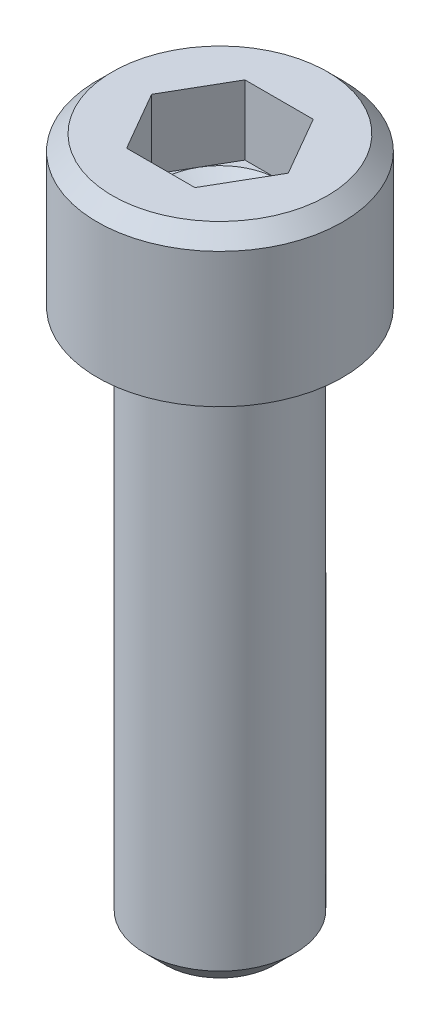
ISO-10303-21;
HEADER;
FILE_DESCRIPTION(('STEP AP214'),'2;1');
FILE_NAME('part.step','',(''),(''),'','','');
FILE_SCHEMA(('AUTOMOTIVE_DESIGN { 1 0 10303 214 1 1 1 1 }'));
ENDSEC;
DATA;
#1=APPLICATION_CONTEXT('core data for automotive mechanical design processes');
#2=APPLICATION_PROTOCOL_DEFINITION('international standard','automotive_design',2000,#1);
#3=PRODUCT_CONTEXT('',#1,'mechanical');
#4=PRODUCT('Part','Part','',(#3));
#5=PRODUCT_RELATED_PRODUCT_CATEGORY('part','',(#4));
#6=PRODUCT_DEFINITION_FORMATION('','',#4);
#7=PRODUCT_DEFINITION_CONTEXT('part definition',#1,'design');
#8=PRODUCT_DEFINITION('design','',#6,#7);
#9=PRODUCT_DEFINITION_SHAPE('','',#8);
#10=(LENGTH_UNIT() NAMED_UNIT(*) SI_UNIT(.MILLI.,.METRE.));
#11=(NAMED_UNIT(*) PLANE_ANGLE_UNIT() SI_UNIT($,.RADIAN.));
#12=(NAMED_UNIT(*) SI_UNIT($,.STERADIAN.) SOLID_ANGLE_UNIT());
#13=UNCERTAINTY_MEASURE_WITH_UNIT(LENGTH_MEASURE(1.E-05),#10,'distance_accuracy_value','');
#14=(GEOMETRIC_REPRESENTATION_CONTEXT(3) GLOBAL_UNCERTAINTY_ASSIGNED_CONTEXT((#13)) GLOBAL_UNIT_ASSIGNED_CONTEXT((#10,
#11,#12)) REPRESENTATION_CONTEXT('',''));
#15=CARTESIAN_POINT('',(0.,0.,0.));
#16=DIRECTION('',(0.,0.,1.));
#17=DIRECTION('',(1.,0.,0.));
#18=AXIS2_PLACEMENT_3D('',#15,#16,#17);
#19=CARTESIAN_POINT('',(0.,1.87959999988152,0.));
#20=DIRECTION('',(0.,1.,0.));
#21=DIRECTION('',(0.,0.,1.));
#22=AXIS2_PLACEMENT_3D('',#19,#20,#21);
#23=CONICAL_SURFACE('',#22,1.38429999981327,1.04719755105418);
#24=CARTESIAN_POINT('',(0.,1.08037402230821,-1.70530256582424E-10));
#25=VERTEX_POINT('',#24);
#26=VERTEX_LOOP('',#25);
#27=FACE_BOUND('',#26,.T.);
#28=CARTESIAN_POINT('',(0.,1.87959999997998,0.));
#29=DIRECTION('',(0.,1.,0.));
#30=DIRECTION('',(0.,0.,1.));
#31=AXIS2_PLACEMENT_3D('',#28,#29,#30);
#32=CIRCLE('',#31,1.3842999999838);
#33=CARTESIAN_POINT('',(-1.19883896645178,1.87959999998999,-0.692149999995949));
#34=VERTEX_POINT('',#33);
#35=CARTESIAN_POINT('',(0.,1.87959999998999,-1.3842999999919));
#36=VERTEX_POINT('',#35);
#37=EDGE_CURVE('E150',#34,#36,#32,.F.);
#38=ORIENTED_EDGE('',*,*,#37,.F.);
#39=CARTESIAN_POINT('',(0.,1.87959999997998,0.));
#40=DIRECTION('',(0.,1.,0.));
#41=DIRECTION('',(0.,0.,1.));
#42=AXIS2_PLACEMENT_3D('',#39,#40,#41);
#43=CIRCLE('',#42,1.3842999999838);
#44=CARTESIAN_POINT('',(-1.19883896645178,1.87959999998999,0.692149999995947));
#45=VERTEX_POINT('',#44);
#46=EDGE_CURVE('E97',#45,#34,#43,.F.);
#47=ORIENTED_EDGE('',*,*,#46,.F.);
#48=CARTESIAN_POINT('',(0.,1.87959999997998,0.));
#49=DIRECTION('',(0.,1.,0.));
#50=DIRECTION('',(0.,0.,1.));
#51=AXIS2_PLACEMENT_3D('',#48,#49,#50);
#52=CIRCLE('',#51,1.3842999999838);
#53=CARTESIAN_POINT('',(0.,1.87959999998999,1.3842999999919));
#54=VERTEX_POINT('',#53);
#55=EDGE_CURVE('E93',#54,#45,#52,.F.);
#56=ORIENTED_EDGE('',*,*,#55,.F.);
#57=CARTESIAN_POINT('',(0.,1.87959999997998,0.));
#58=DIRECTION('',(0.,1.,0.));
#59=DIRECTION('',(0.,0.,1.));
#60=AXIS2_PLACEMENT_3D('',#57,#58,#59);
#61=CIRCLE('',#60,1.3842999999838);
#62=CARTESIAN_POINT('',(1.19883896645178,1.87959999998999,0.692149999995948));
#63=VERTEX_POINT('',#62);
#64=EDGE_CURVE('E91',#63,#54,#61,.F.);
#65=ORIENTED_EDGE('',*,*,#64,.F.);
#66=CARTESIAN_POINT('',(0.,1.87959999997998,0.));
#67=DIRECTION('',(0.,1.,0.));
#68=DIRECTION('',(0.,0.,1.));
#69=AXIS2_PLACEMENT_3D('',#66,#67,#68);
#70=CIRCLE('',#69,1.3842999999838);
#71=CARTESIAN_POINT('',(1.19883896645178,1.87959999998999,-0.692149999995948));
#72=VERTEX_POINT('',#71);
#73=EDGE_CURVE('E21',#72,#63,#70,.F.);
#74=ORIENTED_EDGE('',*,*,#73,.F.);
#75=CARTESIAN_POINT('',(0.,1.87959999997998,0.));
#76=DIRECTION('',(0.,1.,0.));
#77=DIRECTION('',(0.,0.,1.));
#78=AXIS2_PLACEMENT_3D('',#75,#76,#77);
#79=CIRCLE('',#78,1.3842999999838);
#80=EDGE_CURVE('E108',#36,#72,#79,.F.);
#81=ORIENTED_EDGE('',*,*,#80,.F.);
#82=EDGE_LOOP('',(#38,#47,#56,#65,#74,#81));
#83=FACE_BOUND('',#82,.T.);
#84=ADVANCED_FACE('F18',(#27,#83),#23,.F.);
#85=CARTESIAN_POINT('',(0.,1.8796,0.));
#86=DIRECTION('',(0.,1.,0.));
#87=DIRECTION('',(0.,0.,1.));
#88=AXIS2_PLACEMENT_3D('',#85,#86,#87);
#89=PLANE('',#88);
#90=DIRECTION('',(0.5,0.,-0.866025403784438));
#91=VECTOR('',#90,1.);
#92=CARTESIAN_POINT('',(0.799225977639199,1.8796,1.3843));
#93=LINE('',#92,#91);
#94=CARTESIAN_POINT('',(1.5984519552784,1.8796,0.));
#95=VERTEX_POINT('',#94);
#96=EDGE_CURVE('E103',#63,#95,#93,.T.);
#97=ORIENTED_EDGE('',*,*,#96,.T.);
#98=DIRECTION('',(-0.499999999999999,0.,-0.866025403784439));
#99=VECTOR('',#98,1.);
#100=CARTESIAN_POINT('',(1.5984519552784,1.8796,0.));
#101=LINE('',#100,#99);
#102=EDGE_CURVE('E106',#95,#72,#101,.T.);
#103=ORIENTED_EDGE('',*,*,#102,.T.);
#104=ORIENTED_EDGE('',*,*,#73,.T.);
#105=EDGE_LOOP('',(#97,#103,#104));
#106=FACE_BOUND('',#105,.T.);
#107=ADVANCED_FACE('F101',(#106),#89,.T.);
#108=CARTESIAN_POINT('',(0.,1.8796,0.));
#109=DIRECTION('',(0.,1.,0.));
#110=DIRECTION('',(0.,0.,1.));
#111=AXIS2_PLACEMENT_3D('',#108,#109,#110);
#112=PLANE('',#111);
#113=DIRECTION('',(-0.499999999999999,0.,-0.866025403784439));
#114=VECTOR('',#113,1.);
#115=CARTESIAN_POINT('',(1.5984519552784,1.8796,0.));
#116=LINE('',#115,#114);
#117=CARTESIAN_POINT('',(0.799225977639201,1.8796,-1.3843));
#118=VERTEX_POINT('',#117);
#119=EDGE_CURVE('E117',#72,#118,#116,.T.);
#120=ORIENTED_EDGE('',*,*,#119,.T.);
#121=DIRECTION('',(-1.,0.,0.));
#122=VECTOR('',#121,1.);
#123=CARTESIAN_POINT('',(0.799225977639201,1.8796,-1.3843));
#124=LINE('',#123,#122);
#125=EDGE_CURVE('E157',#118,#36,#124,.T.);
#126=ORIENTED_EDGE('',*,*,#125,.T.);
#127=ORIENTED_EDGE('',*,*,#80,.T.);
#128=EDGE_LOOP('',(#120,#126,#127));
#129=FACE_BOUND('',#128,.T.);
#130=ADVANCED_FACE('F154',(#129),#112,.T.);
#131=CARTESIAN_POINT('',(0.,1.8796,0.));
#132=DIRECTION('',(0.,1.,0.));
#133=DIRECTION('',(0.,0.,1.));
#134=AXIS2_PLACEMENT_3D('',#131,#132,#133);
#135=PLANE('',#134);
#136=DIRECTION('',(-1.,0.,0.));
#137=VECTOR('',#136,1.);
#138=CARTESIAN_POINT('',(0.799225977639201,1.8796,-1.3843));
#139=LINE('',#138,#137);
#140=CARTESIAN_POINT('',(-0.799225977639196,1.8796,-1.3843));
#141=VERTEX_POINT('',#140);
#142=EDGE_CURVE('E162',#36,#141,#139,.T.);
#143=ORIENTED_EDGE('',*,*,#142,.T.);
#144=DIRECTION('',(-0.5,0.,0.866025403784438));
#145=VECTOR('',#144,1.);
#146=CARTESIAN_POINT('',(-0.799225977639196,1.8796,-1.3843));
#147=LINE('',#146,#145);
#148=EDGE_CURVE('E165',#141,#34,#147,.T.);
#149=ORIENTED_EDGE('',*,*,#148,.T.);
#150=ORIENTED_EDGE('',*,*,#37,.T.);
#151=EDGE_LOOP('',(#143,#149,#150));
#152=FACE_BOUND('',#151,.T.);
#153=ADVANCED_FACE('F161',(#152),#135,.T.);
#154=CARTESIAN_POINT('',(0.,1.8796,0.));
#155=DIRECTION('',(0.,1.,0.));
#156=DIRECTION('',(0.,0.,1.));
#157=AXIS2_PLACEMENT_3D('',#154,#155,#156);
#158=PLANE('',#157);
#159=DIRECTION('',(-0.5,0.,0.866025403784438));
#160=VECTOR('',#159,1.);
#161=CARTESIAN_POINT('',(-0.799225977639196,1.8796,-1.3843));
#162=LINE('',#161,#160);
#163=CARTESIAN_POINT('',(-1.5984519552784,1.8796,0.));
#164=VERTEX_POINT('',#163);
#165=EDGE_CURVE('E173',#34,#164,#162,.T.);
#166=ORIENTED_EDGE('',*,*,#165,.T.);
#167=DIRECTION('',(0.5,0.,0.866025403784439));
#168=VECTOR('',#167,1.);
#169=CARTESIAN_POINT('',(-1.5984519552784,1.8796,0.));
#170=LINE('',#169,#168);
#171=EDGE_CURVE('E232',#164,#45,#170,.T.);
#172=ORIENTED_EDGE('',*,*,#171,.T.);
#173=ORIENTED_EDGE('',*,*,#46,.T.);
#174=EDGE_LOOP('',(#166,#172,#173));
#175=FACE_BOUND('',#174,.T.);
#176=ADVANCED_FACE('F337',(#175),#158,.T.);
#177=CARTESIAN_POINT('',(0.,1.8796,0.));
#178=DIRECTION('',(0.,1.,0.));
#179=DIRECTION('',(0.,0.,1.));
#180=AXIS2_PLACEMENT_3D('',#177,#178,#179);
#181=PLANE('',#180);
#182=DIRECTION('',(1.,0.,0.));
#183=VECTOR('',#182,1.);
#184=CARTESIAN_POINT('',(-0.799225977639198,1.8796,1.3843));
#185=LINE('',#184,#183);
#186=CARTESIAN_POINT('',(0.799225977639199,1.8796,1.3843));
#187=VERTEX_POINT('',#186);
#188=EDGE_CURVE('E113',#54,#187,#185,.T.);
#189=ORIENTED_EDGE('',*,*,#188,.T.);
#190=DIRECTION('',(0.5,0.,-0.866025403784438));
#191=VECTOR('',#190,1.);
#192=CARTESIAN_POINT('',(0.799225977639199,1.8796,1.3843));
#193=LINE('',#192,#191);
#194=EDGE_CURVE('E110',#187,#63,#193,.T.);
#195=ORIENTED_EDGE('',*,*,#194,.T.);
#196=ORIENTED_EDGE('',*,*,#64,.T.);
#197=EDGE_LOOP('',(#189,#195,#196));
#198=FACE_BOUND('',#197,.T.);
#199=ADVANCED_FACE('F111',(#198),#181,.T.);
#200=CARTESIAN_POINT('',(0.,1.8796,0.));
#201=DIRECTION('',(0.,1.,0.));
#202=DIRECTION('',(0.,0.,1.));
#203=AXIS2_PLACEMENT_3D('',#200,#201,#202);
#204=PLANE('',#203);
#205=DIRECTION('',(0.5,0.,0.866025403784439));
#206=VECTOR('',#205,1.);
#207=CARTESIAN_POINT('',(-1.5984519552784,1.8796,0.));
#208=LINE('',#207,#206);
#209=CARTESIAN_POINT('',(-0.799225977639199,1.8796,1.3843));
#210=VERTEX_POINT('',#209);
#211=EDGE_CURVE('E169',#45,#210,#208,.T.);
#212=ORIENTED_EDGE('',*,*,#211,.T.);
#213=DIRECTION('',(1.,0.,0.));
#214=VECTOR('',#213,1.);
#215=CARTESIAN_POINT('',(-0.799225977639198,1.8796,1.3843));
#216=LINE('',#215,#214);
#217=EDGE_CURVE('E133',#210,#54,#216,.T.);
#218=ORIENTED_EDGE('',*,*,#217,.T.);
#219=ORIENTED_EDGE('',*,*,#55,.T.);
#220=EDGE_LOOP('',(#212,#218,#219));
#221=FACE_BOUND('',#220,.T.);
#222=ADVANCED_FACE('F331',(#221),#204,.T.);
#223=CARTESIAN_POINT('',(0.799225977639199,3.5052,1.3843));
#224=DIRECTION('',(0.866025403784438,0.,0.5));
#225=DIRECTION('',(0.5,0.,-0.866025403784438));
#226=AXIS2_PLACEMENT_3D('',#223,#224,#225);
#227=PLANE('',#226);
#228=DIRECTION('',(0.,1.,0.));
#229=VECTOR('',#228,1.);
#230=CARTESIAN_POINT('',(0.799225977639199,3.5052,1.3843));
#231=LINE('',#230,#229);
#232=CARTESIAN_POINT('',(0.799225977639199,3.5052,1.3843));
#233=VERTEX_POINT('',#232);
#234=EDGE_CURVE('E240',#187,#233,#231,.T.);
#235=ORIENTED_EDGE('',*,*,#234,.T.);
#236=DIRECTION('',(0.500000000000001,0.,-0.866025403784438));
#237=VECTOR('',#236,1.);
#238=CARTESIAN_POINT('',(0.799225977639199,3.5052,1.3843));
#239=LINE('',#238,#237);
#240=CARTESIAN_POINT('',(1.5984519552784,3.5052,0.));
#241=VERTEX_POINT('',#240);
#242=EDGE_CURVE('E130',#233,#241,#239,.T.);
#243=ORIENTED_EDGE('',*,*,#242,.T.);
#244=DIRECTION('',(0.,1.,0.));
#245=VECTOR('',#244,1.);
#246=CARTESIAN_POINT('',(1.5984519552784,3.5052,0.));
#247=LINE('',#246,#245);
#248=EDGE_CURVE('E121',#241,#95,#247,.F.);
#249=ORIENTED_EDGE('',*,*,#248,.T.);
#250=ORIENTED_EDGE('',*,*,#96,.F.);
#251=ORIENTED_EDGE('',*,*,#194,.F.);
#252=EDGE_LOOP('',(#235,#243,#249,#250,#251));
#253=FACE_BOUND('',#252,.T.);
#254=ADVANCED_FACE('F119',(#253),#227,.F.);
#255=CARTESIAN_POINT('',(1.5984519552784,3.5052,0.));
#256=DIRECTION('',(0.866025403784439,0.,-0.499999999999999));
#257=DIRECTION('',(-0.499999999999999,0.,-0.866025403784439));
#258=AXIS2_PLACEMENT_3D('',#255,#256,#257);
#259=PLANE('',#258);
#260=ORIENTED_EDGE('',*,*,#248,.F.);
#261=DIRECTION('',(-0.5,0.,-0.866025403784439));
#262=VECTOR('',#261,1.);
#263=CARTESIAN_POINT('',(1.5984519552784,3.5052,0.));
#264=LINE('',#263,#262);
#265=CARTESIAN_POINT('',(0.799225977639201,3.5052,-1.3843));
#266=VERTEX_POINT('',#265);
#267=EDGE_CURVE('E132',#241,#266,#264,.T.);
#268=ORIENTED_EDGE('',*,*,#267,.T.);
#269=DIRECTION('',(0.,1.,0.));
#270=VECTOR('',#269,1.);
#271=CARTESIAN_POINT('',(0.799225977639201,3.5052,-1.3843));
#272=LINE('',#271,#270);
#273=EDGE_CURVE('E181',#266,#118,#272,.F.);
#274=ORIENTED_EDGE('',*,*,#273,.T.);
#275=ORIENTED_EDGE('',*,*,#119,.F.);
#276=ORIENTED_EDGE('',*,*,#102,.F.);
#277=EDGE_LOOP('',(#260,#268,#274,#275,#276));
#278=FACE_BOUND('',#277,.T.);
#279=ADVANCED_FACE('F220',(#278),#259,.F.);
#280=CARTESIAN_POINT('',(0.799225977639201,3.5052,-1.3843));
#281=DIRECTION('',(0.,0.,-1.));
#282=DIRECTION('',(-1.,0.,0.));
#283=AXIS2_PLACEMENT_3D('',#280,#281,#282);
#284=PLANE('',#283);
#285=ORIENTED_EDGE('',*,*,#273,.F.);
#286=DIRECTION('',(1.,0.,0.));
#287=VECTOR('',#286,1.);
#288=CARTESIAN_POINT('',(0.,3.5052,-1.3843));
#289=LINE('',#288,#287);
#290=CARTESIAN_POINT('',(-0.799225977639196,3.5052,-1.3843));
#291=VERTEX_POINT('',#290);
#292=EDGE_CURVE('E191',#266,#291,#289,.F.);
#293=ORIENTED_EDGE('',*,*,#292,.T.);
#294=DIRECTION('',(0.,1.,0.));
#295=VECTOR('',#294,1.);
#296=CARTESIAN_POINT('',(-0.799225977639196,3.5052,-1.3843));
#297=LINE('',#296,#295);
#298=EDGE_CURVE('E170',#291,#141,#297,.F.);
#299=ORIENTED_EDGE('',*,*,#298,.T.);
#300=ORIENTED_EDGE('',*,*,#142,.F.);
#301=ORIENTED_EDGE('',*,*,#125,.F.);
#302=EDGE_LOOP('',(#285,#293,#299,#300,#301));
#303=FACE_BOUND('',#302,.T.);
#304=ADVANCED_FACE('F225',(#303),#284,.F.);
#305=CARTESIAN_POINT('',(-0.799225977639196,3.5052,-1.3843));
#306=DIRECTION('',(-0.866025403784438,0.,-0.5));
#307=DIRECTION('',(-0.5,0.,0.866025403784438));
#308=AXIS2_PLACEMENT_3D('',#305,#306,#307);
#309=PLANE('',#308);
#310=ORIENTED_EDGE('',*,*,#298,.F.);
#311=DIRECTION('',(-0.500000000000003,0.,0.866025403784437));
#312=VECTOR('',#311,1.);
#313=CARTESIAN_POINT('',(-0.799225977639196,3.5052,-1.3843));
#314=LINE('',#313,#312);
#315=CARTESIAN_POINT('',(-1.5984519552784,3.5052,0.));
#316=VERTEX_POINT('',#315);
#317=EDGE_CURVE('E189',#291,#316,#314,.T.);
#318=ORIENTED_EDGE('',*,*,#317,.T.);
#319=DIRECTION('',(0.,1.,0.));
#320=VECTOR('',#319,1.);
#321=CARTESIAN_POINT('',(-1.5984519552784,3.5052,0.));
#322=LINE('',#321,#320);
#323=EDGE_CURVE('E175',#316,#164,#322,.F.);
#324=ORIENTED_EDGE('',*,*,#323,.T.);
#325=ORIENTED_EDGE('',*,*,#165,.F.);
#326=ORIENTED_EDGE('',*,*,#148,.F.);
#327=EDGE_LOOP('',(#310,#318,#324,#325,#326));
#328=FACE_BOUND('',#327,.T.);
#329=ADVANCED_FACE('F174',(#328),#309,.F.);
#330=CARTESIAN_POINT('',(-1.5984519552784,3.5052,0.));
#331=DIRECTION('',(-0.866025403784439,0.,0.5));
#332=DIRECTION('',(0.5,0.,0.866025403784439));
#333=AXIS2_PLACEMENT_3D('',#330,#331,#332);
#334=PLANE('',#333);
#335=ORIENTED_EDGE('',*,*,#323,.F.);
#336=DIRECTION('',(0.500000000000001,0.,0.866025403784438));
#337=VECTOR('',#336,1.);
#338=CARTESIAN_POINT('',(-1.5984519552784,3.5052,0.));
#339=LINE('',#338,#337);
#340=CARTESIAN_POINT('',(-0.799225977639198,3.5052,1.3843));
#341=VERTEX_POINT('',#340);
#342=EDGE_CURVE('E36',#316,#341,#339,.T.);
#343=ORIENTED_EDGE('',*,*,#342,.T.);
#344=DIRECTION('',(0.,1.,0.));
#345=VECTOR('',#344,1.);
#346=CARTESIAN_POINT('',(-0.799225977639198,3.5052,1.3843));
#347=LINE('',#346,#345);
#348=EDGE_CURVE('E242',#341,#210,#347,.F.);
#349=ORIENTED_EDGE('',*,*,#348,.T.);
#350=ORIENTED_EDGE('',*,*,#211,.F.);
#351=ORIENTED_EDGE('',*,*,#171,.F.);
#352=EDGE_LOOP('',(#335,#343,#349,#350,#351));
#353=FACE_BOUND('',#352,.T.);
#354=ADVANCED_FACE('F230',(#353),#334,.F.);
#355=CARTESIAN_POINT('',(-0.799225977639198,3.5052,1.3843));
#356=DIRECTION('',(0.,0.,1.));
#357=DIRECTION('',(1.,0.,0.));
#358=AXIS2_PLACEMENT_3D('',#355,#356,#357);
#359=PLANE('',#358);
#360=ORIENTED_EDGE('',*,*,#348,.F.);
#361=DIRECTION('',(1.,0.,0.));
#362=VECTOR('',#361,1.);
#363=CARTESIAN_POINT('',(0.,3.5052,1.3843));
#364=LINE('',#363,#362);
#365=EDGE_CURVE('E146',#341,#233,#364,.T.);
#366=ORIENTED_EDGE('',*,*,#365,.T.);
#367=ORIENTED_EDGE('',*,*,#234,.F.);
#368=ORIENTED_EDGE('',*,*,#188,.F.);
#369=ORIENTED_EDGE('',*,*,#217,.F.);
#370=EDGE_LOOP('',(#360,#366,#367,#368,#369));
#371=FACE_BOUND('',#370,.T.);
#372=ADVANCED_FACE('F317',(#371),#359,.F.);
#373=CARTESIAN_POINT('',(0.,3.5052,0.));
#374=DIRECTION('',(0.,-1.,0.));
#375=DIRECTION('',(0.,0.,-1.));
#376=AXIS2_PLACEMENT_3D('',#373,#374,#375);
#377=PLANE('',#376);
#378=ORIENTED_EDGE('',*,*,#342,.F.);
#379=ORIENTED_EDGE('',*,*,#317,.F.);
#380=ORIENTED_EDGE('',*,*,#292,.F.);
#381=ORIENTED_EDGE('',*,*,#267,.F.);
#382=ORIENTED_EDGE('',*,*,#242,.F.);
#383=ORIENTED_EDGE('',*,*,#365,.F.);
#384=EDGE_LOOP('',(#378,#379,#380,#381,#382,#383));
#385=FACE_BOUND('',#384,.T.);
#386=CARTESIAN_POINT('',(0.,3.50519999989274,0.));
#387=DIRECTION('',(0.,-1.,0.));
#388=DIRECTION('',(1.,0.,0.));
#389=AXIS2_PLACEMENT_3D('',#386,#387,#388);
#390=CIRCLE('',#389,2.51460000004045);
#391=CARTESIAN_POINT('',(2.51460000004045,3.50519999989274,0.));
#392=VERTEX_POINT('',#391);
#393=EDGE_CURVE('E144',#392,#392,#390,.T.);
#394=ORIENTED_EDGE('',*,*,#393,.F.);
#395=EDGE_LOOP('',(#394));
#396=FACE_BOUND('',#395,.T.);
#397=ADVANCED_FACE('F227',(#385,#396),#377,.F.);
#398=CARTESIAN_POINT('',(0.,3.149599999972,0.));
#399=DIRECTION('',(0.,-1.,0.));
#400=DIRECTION('',(1.,0.,0.));
#401=AXIS2_PLACEMENT_3D('',#398,#399,#400);
#402=CONICAL_SURFACE('',#401,2.87020000001803,0.785398163477374);
#403=CARTESIAN_POINT('',(0.,3.1496,0.));
#404=DIRECTION('',(0.,-1.,0.));
#405=DIRECTION('',(0.,0.,-1.));
#406=AXIS2_PLACEMENT_3D('',#403,#404,#405);
#407=CIRCLE('',#406,2.8702);
#408=CARTESIAN_POINT('',(0.,3.1496,-2.8702));
#409=VERTEX_POINT('',#408);
#410=EDGE_CURVE('E143',#409,#409,#407,.T.);
#411=ORIENTED_EDGE('',*,*,#410,.F.);
#412=EDGE_LOOP('',(#411));
#413=FACE_BOUND('',#412,.T.);
#414=ORIENTED_EDGE('',*,*,#393,.T.);
#415=EDGE_LOOP('',(#414));
#416=FACE_BOUND('',#415,.T.);
#417=ADVANCED_FACE('F310',(#413,#416),#402,.T.);
#418=CARTESIAN_POINT('',(0.,4.31546,0.));
#419=DIRECTION('',(0.,-1.,0.));
#420=DIRECTION('',(0.,0.,-1.));
#421=AXIS2_PLACEMENT_3D('',#418,#419,#420);
#422=CYLINDRICAL_SURFACE('',#421,2.8702);
#423=CARTESIAN_POINT('',(0.,0.,0.));
#424=DIRECTION('',(0.,-1.,0.));
#425=DIRECTION('',(0.,0.,-1.));
#426=AXIS2_PLACEMENT_3D('',#423,#424,#425);
#427=CIRCLE('',#426,2.8702);
#428=CARTESIAN_POINT('',(0.,0.,-2.8702));
#429=VERTEX_POINT('',#428);
#430=EDGE_CURVE('E140',#429,#429,#427,.T.);
#431=ORIENTED_EDGE('',*,*,#430,.F.);
#432=EDGE_LOOP('',(#431));
#433=FACE_BOUND('',#432,.T.);
#434=ORIENTED_EDGE('',*,*,#410,.T.);
#435=EDGE_LOOP('',(#434));
#436=FACE_BOUND('',#435,.T.);
#437=ADVANCED_FACE('F307',(#433,#436),#422,.T.);
#438=CARTESIAN_POINT('',(0.,0.,0.));
#439=DIRECTION('',(0.,-1.,0.));
#440=DIRECTION('',(0.,0.,-1.));
#441=AXIS2_PLACEMENT_3D('',#438,#439,#440);
#442=PLANE('',#441);
#443=CARTESIAN_POINT('',(0.,0.,0.));
#444=DIRECTION('',(0.,-1.,0.));
#445=DIRECTION('',(-1.,0.,-2.47618082076463E-13));
#446=AXIS2_PLACEMENT_3D('',#443,#444,#445);
#447=CIRCLE('',#446,2.0066);
#448=CARTESIAN_POINT('',(-2.0066,0.,-4.9687044349463E-13));
#449=VERTEX_POINT('',#448);
#450=EDGE_CURVE('E139',#449,#449,#447,.F.);
#451=ORIENTED_EDGE('',*,*,#450,.T.);
#452=EDGE_LOOP('',(#451));
#453=FACE_BOUND('',#452,.T.);
#454=ORIENTED_EDGE('',*,*,#430,.T.);
#455=EDGE_LOOP('',(#454));
#456=FACE_BOUND('',#455,.T.);
#457=ADVANCED_FACE('F298',(#453,#456),#442,.T.);
#458=CARTESIAN_POINT('',(0.,-12.7,0.));
#459=DIRECTION('',(0.,-1.,0.));
#460=DIRECTION('',(0.,0.,-1.));
#461=AXIS2_PLACEMENT_3D('',#458,#459,#460);
#462=PLANE('',#461);
#463=CARTESIAN_POINT('',(0.,-12.6999999999384,0.));
#464=DIRECTION('',(0.,1.,0.));
#465=DIRECTION('',(-1.,0.,0.));
#466=AXIS2_PLACEMENT_3D('',#463,#464,#465);
#467=CIRCLE('',#466,1.28015999996478);
#468=CARTESIAN_POINT('',(-1.28015999996478,-12.6999999999384,0.));
#469=VERTEX_POINT('',#468);
#470=EDGE_CURVE('E136',#469,#469,#467,.T.);
#471=ORIENTED_EDGE('',*,*,#470,.F.);
#472=EDGE_LOOP('',(#471));
#473=FACE_BOUND('',#472,.T.);
#474=ADVANCED_FACE('F285',(#473),#462,.T.);
#475=CARTESIAN_POINT('',(0.,-0.254,0.));
#476=DIRECTION('',(0.,-1.,0.));
#477=DIRECTION('',(0.,0.,-1.));
#478=AXIS2_PLACEMENT_3D('',#475,#476,#477);
#479=TOROIDAL_SURFACE('',#478,2.0066,0.254);
#480=CARTESIAN_POINT('',(0.,-0.254,0.));
#481=DIRECTION('',(0.,-1.,0.));
#482=DIRECTION('',(0.,0.,-1.));
#483=AXIS2_PLACEMENT_3D('',#480,#481,#482);
#484=CIRCLE('',#483,1.7526);
#485=CARTESIAN_POINT('',(0.,-0.254,-1.7526));
#486=VERTEX_POINT('',#485);
#487=EDGE_CURVE('E27',#486,#486,#484,.T.);
#488=ORIENTED_EDGE('',*,*,#487,.F.);
#489=EDGE_LOOP('',(#488));
#490=FACE_BOUND('',#489,.T.);
#491=ORIENTED_EDGE('',*,*,#450,.F.);
#492=EDGE_LOOP('',(#491));
#493=FACE_BOUND('',#492,.T.);
#494=ADVANCED_FACE('F273',(#490,#493),#479,.F.);
#495=CARTESIAN_POINT('',(0.,-12.2275599999853,0.));
#496=DIRECTION('',(0.,1.,0.));
#497=DIRECTION('',(-1.,0.,0.));
#498=AXIS2_PLACEMENT_3D('',#495,#496,#497);
#499=CONICAL_SURFACE('',#498,1.75259999991795,0.785398163397448);
#500=ORIENTED_EDGE('',*,*,#470,.T.);
#501=EDGE_LOOP('',(#500));
#502=FACE_BOUND('',#501,.T.);
#503=CARTESIAN_POINT('',(0.,-12.22756,0.));
#504=DIRECTION('',(0.,-1.,0.));
#505=DIRECTION('',(0.,0.,-1.));
#506=AXIS2_PLACEMENT_3D('',#503,#504,#505);
#507=CIRCLE('',#506,1.7526);
#508=CARTESIAN_POINT('',(0.,-12.22756,-1.7526));
#509=VERTEX_POINT('',#508);
#510=EDGE_CURVE('E11',#509,#509,#507,.F.);
#511=ORIENTED_EDGE('',*,*,#510,.F.);
#512=EDGE_LOOP('',(#511));
#513=FACE_BOUND('',#512,.T.);
#514=ADVANCED_FACE('F284',(#502,#513),#499,.T.);
#515=CARTESIAN_POINT('',(0.,4.31546,0.));
#516=DIRECTION('',(0.,-1.,0.));
#517=DIRECTION('',(0.,0.,-1.));
#518=AXIS2_PLACEMENT_3D('',#515,#516,#517);
#519=CYLINDRICAL_SURFACE('',#518,1.7526);
#520=ORIENTED_EDGE('',*,*,#510,.T.);
#521=EDGE_LOOP('',(#520));
#522=FACE_BOUND('',#521,.T.);
#523=ORIENTED_EDGE('',*,*,#487,.T.);
#524=EDGE_LOOP('',(#523));
#525=FACE_BOUND('',#524,.T.);
#526=ADVANCED_FACE('F349',(#522,#525),#519,.T.);
#527=CLOSED_SHELL('',(#84,#107,#130,#153,#176,#199,#222,#254,#279,#304,#329,#354,#372,#397,#417,
#437,#457,#474,#494,#514,#526));
#528=MANIFOLD_SOLID_BREP('B1',#527);
#529=ADVANCED_BREP_SHAPE_REPRESENTATION('',(#18,#528),#14);
#530=SHAPE_DEFINITION_REPRESENTATION(#9,#529);
ENDSEC;
END-ISO-10303-21;
